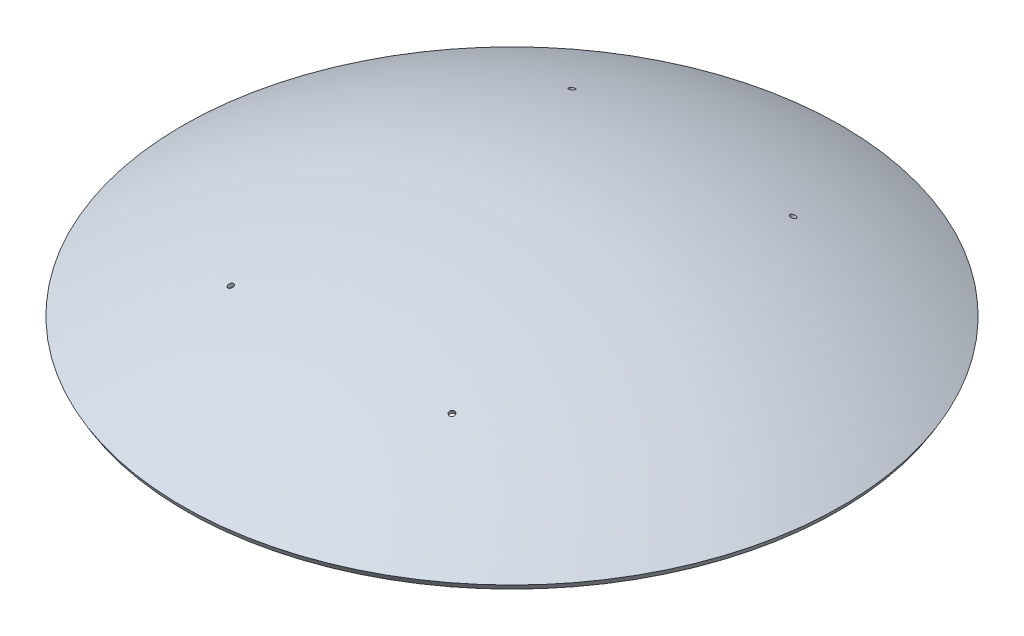
ISO-10303-21;
HEADER;
FILE_DESCRIPTION(('STEP AP214'),'2;1');
FILE_NAME('part.step','',(''),(''),'','','');
FILE_SCHEMA(('AUTOMOTIVE_DESIGN { 1 0 10303 214 1 1 1 1 }'));
ENDSEC;
DATA;
#1=APPLICATION_CONTEXT('core data for automotive mechanical design processes');
#2=APPLICATION_PROTOCOL_DEFINITION('international standard','automotive_design',2000,#1);
#3=PRODUCT_CONTEXT('',#1,'mechanical');
#4=PRODUCT('Part','Part','',(#3));
#5=PRODUCT_RELATED_PRODUCT_CATEGORY('part','',(#4));
#6=PRODUCT_DEFINITION_FORMATION('','',#4);
#7=PRODUCT_DEFINITION_CONTEXT('part definition',#1,'design');
#8=PRODUCT_DEFINITION('design','',#6,#7);
#9=PRODUCT_DEFINITION_SHAPE('','',#8);
#10=(LENGTH_UNIT() NAMED_UNIT(*) SI_UNIT(.MILLI.,.METRE.));
#11=(NAMED_UNIT(*) PLANE_ANGLE_UNIT() SI_UNIT($,.RADIAN.));
#12=(NAMED_UNIT(*) SI_UNIT($,.STERADIAN.) SOLID_ANGLE_UNIT());
#13=UNCERTAINTY_MEASURE_WITH_UNIT(LENGTH_MEASURE(1.E-05),#10,'distance_accuracy_value','');
#14=(GEOMETRIC_REPRESENTATION_CONTEXT(3) GLOBAL_UNCERTAINTY_ASSIGNED_CONTEXT((#13)) GLOBAL_UNIT_ASSIGNED_CONTEXT((#10,
#11,#12)) REPRESENTATION_CONTEXT('',''));
#15=CARTESIAN_POINT('',(0.,0.,0.));
#16=DIRECTION('',(0.,0.,1.));
#17=DIRECTION('',(1.,0.,0.));
#18=AXIS2_PLACEMENT_3D('',#15,#16,#17);
#19=CARTESIAN_POINT('',(0.,203515.969889343,0.));
#20=DIRECTION('',(0.,1.,0.));
#21=DIRECTION('',(0.,0.,1.));
#22=AXIS2_PLACEMENT_3D('',#19,#20,#21);
#23=CONICAL_SURFACE('',#22,117500.,0.523598775598306);
#24=CARTESIAN_POINT('',(0.,205681.033398804,0.));
#25=DIRECTION('',(0.,-1.,0.));
#26=DIRECTION('',(0.,0.,-1.));
#27=AXIS2_PLACEMENT_3D('',#24,#25,#26);
#28=CIRCLE('',#27,118750.);
#29=CARTESIAN_POINT('',(0.,205681.033398804,-118750.));
#30=VERTEX_POINT('',#29);
#31=EDGE_CURVE('E37',#30,#30,#28,.T.);
#32=ORIENTED_EDGE('',*,*,#31,.T.);
#33=EDGE_LOOP('',(#32));
#34=FACE_BOUND('',#33,.T.);
#35=CARTESIAN_POINT('',(0.,203515.969889343,0.));
#36=DIRECTION('',(0.,-1.,0.));
#37=DIRECTION('',(0.,0.,-1.));
#38=AXIS2_PLACEMENT_3D('',#35,#36,#37);
#39=CIRCLE('',#38,117500.);
#40=CARTESIAN_POINT('',(0.,203515.969889343,-117500.));
#41=VERTEX_POINT('',#40);
#42=EDGE_CURVE('E10',#41,#41,#39,.T.);
#43=ORIENTED_EDGE('',*,*,#42,.F.);
#44=EDGE_LOOP('',(#43));
#45=FACE_BOUND('',#44,.T.);
#46=ADVANCED_FACE('F31',(#34,#45),#23,.T.);
#47=CARTESIAN_POINT('',(0.,0.,0.));
#48=DIRECTION('',(0.,-1.,0.));
#49=DIRECTION('',(-1.,0.,0.));
#50=AXIS2_PLACEMENT_3D('',#47,#48,#49);
#51=SPHERICAL_SURFACE('',#50,235000.);
#52=CARTESIAN_POINT('',(-39413.6339756304,223525.825811059,-60817.519287778));
#53=DIRECTION('',(0.167731259496521,-0.951251242564198,0.258819045102522));
#54=DIRECTION('',(0.,0.262538491736643,0.964921520309631));
#55=AXIS2_PLACEMENT_3D('',#52,#53,#54);
#56=CIRCLE('',#55,3000.);
#57=CARTESIAN_POINT('',(-39413.6339756304,224313.441286269,-57922.7547268491));
#58=VERTEX_POINT('',#57);
#59=EDGE_CURVE('E89',#58,#58,#56,.T.);
#60=ORIENTED_EDGE('',*,*,#59,.F.);
#61=EDGE_LOOP('',(#60));
#62=FACE_BOUND('',#61,.T.);
#63=CARTESIAN_POINT('',(39413.6339756304,223525.825811059,-60817.519287778));
#64=DIRECTION('',(0.167731259496521,0.951251242564198,-0.258819045102522));
#65=DIRECTION('',(0.,0.262538491736643,0.964921520309631));
#66=AXIS2_PLACEMENT_3D('',#63,#64,#65);
#67=CIRCLE('',#66,3000.);
#68=CARTESIAN_POINT('',(39413.6339756304,224313.441286269,-57922.7547268491));
#69=VERTEX_POINT('',#68);
#70=EDGE_CURVE('E77',#69,#69,#67,.T.);
#71=ORIENTED_EDGE('',*,*,#70,.T.);
#72=EDGE_LOOP('',(#71));
#73=FACE_BOUND('',#72,.T.);
#74=CARTESIAN_POINT('',(-39413.6339756304,223525.825811059,60817.519287778));
#75=DIRECTION('',(-0.167731259496521,0.951251242564198,0.258819045102522));
#76=DIRECTION('',(0.,0.262538491736643,-0.964921520309631));
#77=AXIS2_PLACEMENT_3D('',#74,#75,#76);
#78=CIRCLE('',#77,3000.);
#79=CARTESIAN_POINT('',(-39413.6339756304,224313.441286269,57922.7547268491));
#80=VERTEX_POINT('',#79);
#81=EDGE_CURVE('E65',#80,#80,#78,.T.);
#82=ORIENTED_EDGE('',*,*,#81,.T.);
#83=EDGE_LOOP('',(#82));
#84=FACE_BOUND('',#83,.T.);
#85=CARTESIAN_POINT('',(39413.6339756304,223525.825811059,60817.519287778));
#86=DIRECTION('',(-0.167731259496521,-0.951251242564198,-0.258819045102522));
#87=DIRECTION('',(0.,0.262538491736643,-0.964921520309631));
#88=AXIS2_PLACEMENT_3D('',#85,#86,#87);
#89=CIRCLE('',#88,3000.);
#90=CARTESIAN_POINT('',(39413.6339756304,224313.441286269,57922.7547268491));
#91=VERTEX_POINT('',#90);
#92=EDGE_CURVE('E53',#91,#91,#89,.T.);
#93=ORIENTED_EDGE('',*,*,#92,.F.);
#94=EDGE_LOOP('',(#93));
#95=FACE_BOUND('',#94,.T.);
#96=ORIENTED_EDGE('',*,*,#42,.T.);
#97=EDGE_LOOP('',(#96));
#98=FACE_BOUND('',#97,.T.);
#99=ADVANCED_FACE('F95',(#62,#73,#84,#95,#98),#51,.F.);
#100=CARTESIAN_POINT('',(0.,0.,0.));
#101=DIRECTION('',(0.,-1.,0.));
#102=DIRECTION('',(-1.,0.,0.));
#103=AXIS2_PLACEMENT_3D('',#100,#101,#102);
#104=SPHERICAL_SURFACE('',#103,237500.);
#105=CARTESIAN_POINT('',(-39835.8210104176,225920.167465926,-61468.9783272337));
#106=DIRECTION('',(0.167731259496521,-0.951251242564198,0.258819045102522));
#107=DIRECTION('',(0.,0.262538491736643,0.964921520309631));
#108=AXIS2_PLACEMENT_3D('',#105,#106,#107);
#109=CIRCLE('',#108,1000.00000000001);
#110=CARTESIAN_POINT('',(-39835.8210104176,226182.705957663,-60504.056806924));
#111=VERTEX_POINT('',#110);
#112=EDGE_CURVE('E80',#111,#111,#109,.T.);
#113=ORIENTED_EDGE('',*,*,#112,.T.);
#114=EDGE_LOOP('',(#113));
#115=FACE_BOUND('',#114,.T.);
#116=CARTESIAN_POINT('',(39835.8210104176,225920.167465926,-61468.9783272337));
#117=DIRECTION('',(0.167731259496521,0.951251242564198,-0.258819045102522));
#118=DIRECTION('',(0.,0.262538491736643,0.964921520309631));
#119=AXIS2_PLACEMENT_3D('',#116,#117,#118);
#120=CIRCLE('',#119,1000.00000000001);
#121=CARTESIAN_POINT('',(39835.8210104176,226182.705957663,-60504.056806924));
#122=VERTEX_POINT('',#121);
#123=EDGE_CURVE('E68',#122,#122,#120,.T.);
#124=ORIENTED_EDGE('',*,*,#123,.F.);
#125=EDGE_LOOP('',(#124));
#126=FACE_BOUND('',#125,.T.);
#127=CARTESIAN_POINT('',(-39835.8210104176,225920.167465926,61468.9783272337));
#128=DIRECTION('',(-0.167731259496521,0.951251242564198,0.258819045102522));
#129=DIRECTION('',(0.,0.262538491736643,-0.964921520309631));
#130=AXIS2_PLACEMENT_3D('',#127,#128,#129);
#131=CIRCLE('',#130,1000.00000000001);
#132=CARTESIAN_POINT('',(-39835.8210104176,226182.705957663,60504.056806924));
#133=VERTEX_POINT('',#132);
#134=EDGE_CURVE('E56',#133,#133,#131,.T.);
#135=ORIENTED_EDGE('',*,*,#134,.F.);
#136=EDGE_LOOP('',(#135));
#137=FACE_BOUND('',#136,.T.);
#138=CARTESIAN_POINT('',(39835.8210104176,225920.167465926,61468.9783272337));
#139=DIRECTION('',(-0.167731259496521,-0.951251242564198,-0.258819045102522));
#140=DIRECTION('',(0.,0.262538491736643,-0.964921520309631));
#141=AXIS2_PLACEMENT_3D('',#138,#139,#140);
#142=CIRCLE('',#141,1000.00000000001);
#143=CARTESIAN_POINT('',(39835.8210104176,226182.705957663,60504.056806924));
#144=VERTEX_POINT('',#143);
#145=EDGE_CURVE('E41',#144,#144,#142,.T.);
#146=ORIENTED_EDGE('',*,*,#145,.T.);
#147=EDGE_LOOP('',(#146));
#148=FACE_BOUND('',#147,.T.);
#149=ORIENTED_EDGE('',*,*,#31,.F.);
#150=EDGE_LOOP('',(#149));
#151=FACE_BOUND('',#150,.T.);
#152=ADVANCED_FACE('F98',(#115,#126,#137,#148,#151),#104,.T.);
#153=CARTESIAN_POINT('',(35107.4661437942,199104.334474144,54172.8529946107));
#154=DIRECTION('',(-0.167731259496521,-0.951251242564198,-0.258819045102522));
#155=DIRECTION('',(0.,0.262538491736643,-0.964921520309631));
#156=AXIS2_PLACEMENT_3D('',#153,#154,#155);
#157=CYLINDRICAL_SURFACE('',#156,1000.00000000001);
#158=ORIENTED_EDGE('',*,*,#145,.F.);
#159=EDGE_LOOP('',(#158));
#160=FACE_BOUND('',#159,.T.);
#161=CARTESIAN_POINT('',(39626.1550676704,224731.092816631,61145.4516378424));
#162=DIRECTION('',(-0.167731259496521,-0.951251242564198,-0.258819045102522));
#163=DIRECTION('',(0.,0.262538491736643,-0.964921520309631));
#164=AXIS2_PLACEMENT_3D('',#161,#162,#163);
#165=CIRCLE('',#164,1000.00000000001);
#166=CARTESIAN_POINT('',(39671.0985231976,224985.979818873,60179.5258115615));
#167=VERTEX_POINT('',#166);
#168=EDGE_CURVE('E45',#167,#167,#165,.T.);
#169=ORIENTED_EDGE('',*,*,#168,.T.);
#170=EDGE_LOOP('',(#169));
#171=FACE_BOUND('',#170,.T.);
#172=ADVANCED_FACE('F118',(#160,#171),#157,.F.);
#173=CARTESIAN_POINT('',(0.,0.,0.));
#174=DIRECTION('',(-0.167731259496521,-0.951251242564198,-0.258819045102522));
#175=DIRECTION('',(0.044943455527548,0.25488700224418,-0.965925826289068));
#176=AXIS2_PLACEMENT_3D('',#173,#174,#175);
#177=SPHERICAL_SURFACE('',#176,236250.);
#178=CARTESIAN_POINT('',(39623.315046116,224714.986254022,61141.0693201457));
#179=DIRECTION('',(-0.167731259496521,-0.951251242564198,-0.258819045102522));
#180=DIRECTION('',(0.,0.262538491736643,-0.964921520309631));
#181=AXIS2_PLACEMENT_3D('',#178,#179,#180);
#182=CIRCLE('',#181,2999.99999999999);
#183=CARTESIAN_POINT('',(39758.1454126986,225479.647260754,58243.2918412807));
#184=VERTEX_POINT('',#183);
#185=EDGE_CURVE('E50',#184,#184,#182,.T.);
#186=CARTESIAN_POINT('',(39671.0985231976,224985.979818873,60179.5258115615));
#187=CARTESIAN_POINT('',(39672.0200814591,224991.206235487,60159.3789314537));
#188=CARTESIAN_POINT('',(39672.9411769422,224996.430027555,60139.2313493289));
#189=CARTESIAN_POINT('',(39674.782442287,225006.87236223,60098.9347824554));
#190=CARTESIAN_POINT('',(39675.7026121488,225012.090904838,60078.7857977068));
#191=CARTESIAN_POINT('',(39677.5420261867,225022.52274023,60038.4864269959));
#192=CARTESIAN_POINT('',(39678.4612703627,225027.736033013,60018.3360410337));
#193=CARTESIAN_POINT('',(39680.2988329648,225038.157368391,59978.0338693061));
#194=CARTESIAN_POINT('',(39681.2171513908,225043.365410985,59957.8820835407));
#195=CARTESIAN_POINT('',(39683.0528624284,225053.776245619,59917.5771136172));
#196=CARTESIAN_POINT('',(39683.9702550401,225058.979037659,59897.423929459));
#197=CARTESIAN_POINT('',(39685.8041143849,225069.379370821,59857.1161641606));
#198=CARTESIAN_POINT('',(39686.7205811181,225074.576911943,59836.9615830203));
#199=CARTESIAN_POINT('',(39688.5525886417,225084.966742904,59796.6510251683));
#200=CARTESIAN_POINT('',(39689.4681294321,225090.159032744,59776.4950484565));
#201=CARTESIAN_POINT('',(39691.2982850062,225100.538360779,59736.1817008722));
#202=CARTESIAN_POINT('',(39692.2128997899,225105.725398974,59716.0243299997));
#203=CARTESIAN_POINT('',(39694.0412032865,225116.094223355,59675.7081955047));
#204=CARTESIAN_POINT('',(39694.9548919994,225121.276009541,59655.5494318824));
#205=CARTESIAN_POINT('',(39696.7813432905,225131.634329542,59615.2305132987));
#206=CARTESIAN_POINT('',(39697.6941058686,225136.810863357,59595.0703583374));
#207=CARTESIAN_POINT('',(39699.5187048264,225147.158678254,59554.7486584869));
#208=CARTESIAN_POINT('',(39700.4305412059,225152.329959336,59534.5871135978));
#209=CARTESIAN_POINT('',(39702.2532877026,225162.667268405,59494.2626353028));
#210=CARTESIAN_POINT('',(39703.1641978197,225167.833296391,59474.0997018969));
#211=CARTESIAN_POINT('',(39704.9850917277,225178.160098907,59433.7724479797));
#212=CARTESIAN_POINT('',(39705.8950755186,225183.320873436,59413.6081274684));
#213=CARTESIAN_POINT('',(39707.7141167105,225193.637168677,59373.2781007517));
#214=CARTESIAN_POINT('',(39708.6231741115,225198.792689389,59353.1123945462));
#215=CARTESIAN_POINT('',(39710.44036246,225209.098476633,59312.7795978527));
#216=CARTESIAN_POINT('',(39711.3484934075,225214.248743165,59292.6125073646));
#217=CARTESIAN_POINT('',(39713.1638287855,225224.54402169,59252.2769435173));
#218=CARTESIAN_POINT('',(39714.0710332159,225229.689033683,59232.1084701581));
#219=CARTESIAN_POINT('',(39715.8845154962,225239.973802769,59191.7701419802));
#220=CARTESIAN_POINT('',(39716.790793346,225245.113559863,59171.6002871615));
#221=CARTESIAN_POINT('',(39718.6024224017,225255.38781879,59131.2591974763));
#222=CARTESIAN_POINT('',(39719.5077736075,225260.522320624,59111.0879626099));
#223=CARTESIAN_POINT('',(39721.3175493118,225270.786068674,59070.744114241));
#224=CARTESIAN_POINT('',(39722.2219738103,225275.915314889,59050.5715007386));
#225=CARTESIAN_POINT('',(39724.0298960365,225286.168551342,59010.2248965099));
#226=CARTESIAN_POINT('',(39724.9333937643,225291.29254158,58990.0509057835));
#227=CARTESIAN_POINT('',(39726.739462386,225301.535265718,58949.7015485188));
#228=CARTESIAN_POINT('',(39727.6420332798,225306.65399962,58929.5261819804));
#229=CARTESIAN_POINT('',(39729.4462481705,225316.886210728,58889.1740745039));
#230=CARTESIAN_POINT('',(39730.3478921672,225321.999687934,58868.9973335657));
#231=CARTESIAN_POINT('',(39732.1502532006,225332.221385295,58828.6424787016));
#232=CARTESIAN_POINT('',(39733.0509702372,225337.329605449,58808.4643647758));
#233=CARTESIAN_POINT('',(39734.8514772871,225347.540788348,58768.1067653488));
#234=CARTESIAN_POINT('',(39735.7512673004,225352.643751092,58747.9272798477));
#235=CARTESIAN_POINT('',(39737.5499202409,225362.844418813,58707.5669386824));
#236=CARTESIAN_POINT('',(39738.448783168,225367.94212379,58687.3860830183));
#237=CARTESIAN_POINT('',(39740.2455818731,225378.132275619,58647.0230029397));
#238=CARTESIAN_POINT('',(39741.1435176511,225383.224722472,58626.8407785252));
#239=CARTESIAN_POINT('',(39742.938461995,225393.404357697,58586.4749623585));
#240=CARTESIAN_POINT('',(39743.8354705611,225398.49154607,58566.2913706062));
#241=CARTESIAN_POINT('',(39745.6285604183,225408.660663978,58525.9228211764));
#242=CARTESIAN_POINT('',(39746.5246417095,225413.742593514,58505.737863499));
#243=CARTESIAN_POINT('',(39748.3158769545,225423.901193394,58465.3665836319));
#244=CARTESIAN_POINT('',(39749.2110309083,225428.977863737,58445.1802614421));
#245=CARTESIAN_POINT('',(39751.0004114156,225439.125944877,58404.8062539632));
#246=CARTESIAN_POINT('',(39751.8946379692,225444.197355673,58384.618568674));
#247=CARTESIAN_POINT('',(39753.6821636137,225454.334917363,58344.2418364092));
#248=CARTESIAN_POINT('',(39754.5754627046,225459.401068257,58324.0527894335));
#249=CARTESIAN_POINT('',(39756.3611333612,225469.528109787,58283.6733352089));
#250=CARTESIAN_POINT('',(39757.2535049268,225474.589000423,58263.4829279599));
#251=CARTESIAN_POINT('',(39758.1454126986,225479.647260754,58243.2918412807));
#252=B_SPLINE_CURVE_WITH_KNOTS('',3,(#186,#187,#188,#189,#190,#191,#192,#193,#194,#195,#196,
#197,#198,#199,#200,#201,#202,#203,#204,#205,#206,#207,#208,#209,#210,#211,#212,#213,#214,#215,
#216,#217,#218,#219,#220,#221,#222,#223,#224,#225,#226,#227,#228,#229,#230,#231,#232,#233,#234,
#235,#236,#237,#238,#239,#240,#241,#242,#243,#244,#245,#246,#247,#248,#249,#250,#251),
.UNSPECIFIED.,.F.,.F.,(4,2,2,2,2,2,2,2,2,2,2,2,2,2,2,2,2,2,2,2,2,2,2,2,2,2,2,2,2,2,2,2,4),(0.,
62.5024262105206,125.00485242106,187.507278631653,250.009704842173,312.512131052699,
375.014557263235,437.516983473755,500.019409684341,562.521835894869,625.024262105405,
687.526688315939,750.029114526474,812.531540736996,875.033966947585,937.536393158106,
1000.03881936865,1062.54124557917,1125.0436717897,1187.54609800029,1250.04852421082,
1312.55095042134,1375.05337663188,1437.5558028424,1500.05822905294,1562.56065526352,
1625.06308147405,1687.56550768458,1750.0679338951,1812.57036010563,1875.07278631621,
1937.57521252675,2000.07763873729),.UNSPECIFIED.);
#253=EDGE_CURVE('BSEAM108',#167,#184,#252,.T.);
#254=ORIENTED_EDGE('',*,*,#168,.F.);
#255=ORIENTED_EDGE('',*,*,#185,.T.);
#256=ORIENTED_EDGE('',*,*,#253,.T.);
#257=ORIENTED_EDGE('',*,*,#253,.F.);
#258=EDGE_LOOP('',(#254,#256,#255,#257));
#259=FACE_BOUND('',#258,.T.);
#260=ADVANCED_FACE('F108',(#259),#177,.F.);
#261=CARTESIAN_POINT('',(35107.4661437942,199104.334474144,54172.8529946107));
#262=DIRECTION('',(-0.167731259496521,-0.951251242564198,-0.258819045102522));
#263=DIRECTION('',(0.,0.262538491736643,-0.964921520309631));
#264=AXIS2_PLACEMENT_3D('',#261,#262,#263);
#265=CYLINDRICAL_SURFACE('',#264,2999.99999999999);
#266=ORIENTED_EDGE('',*,*,#185,.F.);
#267=EDGE_LOOP('',(#266));
#268=FACE_BOUND('',#267,.T.);
#269=ORIENTED_EDGE('',*,*,#92,.T.);
#270=EDGE_LOOP('',(#269));
#271=FACE_BOUND('',#270,.T.);
#272=ADVANCED_FACE('F105',(#268,#271),#265,.F.);
#273=CARTESIAN_POINT('',(-35107.4661437942,199104.334474144,54172.8529946107));
#274=DIRECTION('',(0.167731259496521,-0.951251242564198,-0.258819045102522));
#275=DIRECTION('',(0.,0.262538491736643,-0.964921520309631));
#276=AXIS2_PLACEMENT_3D('',#273,#274,#275);
#277=CYLINDRICAL_SURFACE('',#276,1000.00000000001);
#278=ORIENTED_EDGE('',*,*,#134,.T.);
#279=EDGE_LOOP('',(#278));
#280=FACE_BOUND('',#279,.T.);
#281=CARTESIAN_POINT('',(-39626.1550676704,224731.092816631,61145.4516378424));
#282=DIRECTION('',(-0.167731259496521,0.951251242564198,0.258819045102522));
#283=DIRECTION('',(0.,0.262538491736643,-0.964921520309631));
#284=AXIS2_PLACEMENT_3D('',#281,#282,#283);
#285=CIRCLE('',#284,1000.00000000001);
#286=CARTESIAN_POINT('',(-39671.0985231976,224985.979818873,60179.5258115615));
#287=VERTEX_POINT('',#286);
#288=EDGE_CURVE('E59',#287,#287,#285,.T.);
#289=ORIENTED_EDGE('',*,*,#288,.F.);
#290=EDGE_LOOP('',(#289));
#291=FACE_BOUND('',#290,.T.);
#292=ADVANCED_FACE('F107',(#280,#291),#277,.F.);
#293=CARTESIAN_POINT('',(0.,0.,0.));
#294=DIRECTION('',(0.167731259496521,-0.951251242564198,-0.258819045102522));
#295=DIRECTION('',(-0.044943455527548,0.25488700224418,-0.965925826289068));
#296=AXIS2_PLACEMENT_3D('',#293,#294,#295);
#297=SPHERICAL_SURFACE('',#296,236250.);
#298=CARTESIAN_POINT('',(-39623.315046116,224714.986254022,61141.0693201457));
#299=DIRECTION('',(-0.167731259496521,0.951251242564198,0.258819045102522));
#300=DIRECTION('',(0.,0.262538491736643,-0.964921520309631));
#301=AXIS2_PLACEMENT_3D('',#298,#299,#300);
#302=CIRCLE('',#301,2999.99999999999);
#303=CARTESIAN_POINT('',(-39758.1454126986,225479.647260754,58243.2918412807));
#304=VERTEX_POINT('',#303);
#305=EDGE_CURVE('E62',#304,#304,#302,.T.);
#306=CARTESIAN_POINT('',(-39671.0985231976,224985.979818873,60179.5258115615));
#307=CARTESIAN_POINT('',(-39672.0200814591,224991.206235487,60159.3789314537));
#308=CARTESIAN_POINT('',(-39672.9411769422,224996.430027555,60139.2313493289));
#309=CARTESIAN_POINT('',(-39674.782442287,225006.87236223,60098.9347824554));
#310=CARTESIAN_POINT('',(-39675.7026121488,225012.090904838,60078.7857977068));
#311=CARTESIAN_POINT('',(-39677.5420261867,225022.52274023,60038.4864269959));
#312=CARTESIAN_POINT('',(-39678.4612703627,225027.736033013,60018.3360410337));
#313=CARTESIAN_POINT('',(-39680.2988329648,225038.157368391,59978.0338693061));
#314=CARTESIAN_POINT('',(-39681.2171513908,225043.365410985,59957.8820835407));
#315=CARTESIAN_POINT('',(-39683.0528624284,225053.776245619,59917.5771136172));
#316=CARTESIAN_POINT('',(-39683.9702550401,225058.979037659,59897.423929459));
#317=CARTESIAN_POINT('',(-39685.8041143849,225069.379370821,59857.1161641606));
#318=CARTESIAN_POINT('',(-39686.7205811181,225074.576911943,59836.9615830203));
#319=CARTESIAN_POINT('',(-39688.5525886417,225084.966742904,59796.6510251683));
#320=CARTESIAN_POINT('',(-39689.4681294321,225090.159032744,59776.4950484565));
#321=CARTESIAN_POINT('',(-39691.2982850062,225100.538360779,59736.1817008722));
#322=CARTESIAN_POINT('',(-39692.2128997899,225105.725398974,59716.0243299997));
#323=CARTESIAN_POINT('',(-39694.0412032865,225116.094223355,59675.7081955047));
#324=CARTESIAN_POINT('',(-39694.9548919994,225121.276009541,59655.5494318824));
#325=CARTESIAN_POINT('',(-39696.7813432905,225131.634329542,59615.2305132987));
#326=CARTESIAN_POINT('',(-39697.6941058686,225136.810863357,59595.0703583374));
#327=CARTESIAN_POINT('',(-39699.5187048264,225147.158678254,59554.7486584869));
#328=CARTESIAN_POINT('',(-39700.4305412059,225152.329959336,59534.5871135978));
#329=CARTESIAN_POINT('',(-39702.2532877026,225162.667268405,59494.2626353028));
#330=CARTESIAN_POINT('',(-39703.1641978197,225167.833296391,59474.0997018969));
#331=CARTESIAN_POINT('',(-39704.9850917277,225178.160098907,59433.7724479797));
#332=CARTESIAN_POINT('',(-39705.8950755186,225183.320873436,59413.6081274684));
#333=CARTESIAN_POINT('',(-39707.7141167105,225193.637168677,59373.2781007517));
#334=CARTESIAN_POINT('',(-39708.6231741115,225198.792689389,59353.1123945462));
#335=CARTESIAN_POINT('',(-39710.44036246,225209.098476633,59312.7795978527));
#336=CARTESIAN_POINT('',(-39711.3484934075,225214.248743165,59292.6125073646));
#337=CARTESIAN_POINT('',(-39713.1638287855,225224.54402169,59252.2769435173));
#338=CARTESIAN_POINT('',(-39714.0710332159,225229.689033683,59232.1084701581));
#339=CARTESIAN_POINT('',(-39715.8845154962,225239.973802769,59191.7701419802));
#340=CARTESIAN_POINT('',(-39716.790793346,225245.113559863,59171.6002871615));
#341=CARTESIAN_POINT('',(-39718.6024224017,225255.38781879,59131.2591974763));
#342=CARTESIAN_POINT('',(-39719.5077736075,225260.522320624,59111.0879626099));
#343=CARTESIAN_POINT('',(-39721.3175493118,225270.786068674,59070.744114241));
#344=CARTESIAN_POINT('',(-39722.2219738103,225275.915314889,59050.5715007386));
#345=CARTESIAN_POINT('',(-39724.0298960365,225286.168551342,59010.2248965099));
#346=CARTESIAN_POINT('',(-39724.9333937643,225291.29254158,58990.0509057835));
#347=CARTESIAN_POINT('',(-39726.739462386,225301.535265718,58949.7015485188));
#348=CARTESIAN_POINT('',(-39727.6420332798,225306.65399962,58929.5261819804));
#349=CARTESIAN_POINT('',(-39729.4462481705,225316.886210728,58889.1740745039));
#350=CARTESIAN_POINT('',(-39730.3478921672,225321.999687934,58868.9973335657));
#351=CARTESIAN_POINT('',(-39732.1502532006,225332.221385295,58828.6424787016));
#352=CARTESIAN_POINT('',(-39733.0509702372,225337.329605449,58808.4643647758));
#353=CARTESIAN_POINT('',(-39734.8514772871,225347.540788348,58768.1067653488));
#354=CARTESIAN_POINT('',(-39735.7512673004,225352.643751092,58747.9272798477));
#355=CARTESIAN_POINT('',(-39737.5499202409,225362.844418813,58707.5669386824));
#356=CARTESIAN_POINT('',(-39738.448783168,225367.94212379,58687.3860830183));
#357=CARTESIAN_POINT('',(-39740.2455818731,225378.132275619,58647.0230029397));
#358=CARTESIAN_POINT('',(-39741.1435176511,225383.224722472,58626.8407785252));
#359=CARTESIAN_POINT('',(-39742.938461995,225393.404357697,58586.4749623585));
#360=CARTESIAN_POINT('',(-39743.8354705611,225398.49154607,58566.2913706062));
#361=CARTESIAN_POINT('',(-39745.6285604183,225408.660663978,58525.9228211764));
#362=CARTESIAN_POINT('',(-39746.5246417095,225413.742593514,58505.737863499));
#363=CARTESIAN_POINT('',(-39748.3158769545,225423.901193394,58465.3665836319));
#364=CARTESIAN_POINT('',(-39749.2110309083,225428.977863737,58445.1802614421));
#365=CARTESIAN_POINT('',(-39751.0004114156,225439.125944877,58404.8062539632));
#366=CARTESIAN_POINT('',(-39751.8946379692,225444.197355673,58384.618568674));
#367=CARTESIAN_POINT('',(-39753.6821636137,225454.334917363,58344.2418364092));
#368=CARTESIAN_POINT('',(-39754.5754627046,225459.401068257,58324.0527894335));
#369=CARTESIAN_POINT('',(-39756.3611333612,225469.528109787,58283.6733352089));
#370=CARTESIAN_POINT('',(-39757.2535049268,225474.589000423,58263.4829279599));
#371=CARTESIAN_POINT('',(-39758.1454126986,225479.647260754,58243.2918412807));
#372=B_SPLINE_CURVE_WITH_KNOTS('',3,(#306,#307,#308,#309,#310,#311,#312,#313,#314,#315,#316,
#317,#318,#319,#320,#321,#322,#323,#324,#325,#326,#327,#328,#329,#330,#331,#332,#333,#334,#335,
#336,#337,#338,#339,#340,#341,#342,#343,#344,#345,#346,#347,#348,#349,#350,#351,#352,#353,#354,
#355,#356,#357,#358,#359,#360,#361,#362,#363,#364,#365,#366,#367,#368,#369,#370,#371),
.UNSPECIFIED.,.F.,.F.,(4,2,2,2,2,2,2,2,2,2,2,2,2,2,2,2,2,2,2,2,2,2,2,2,2,2,2,2,2,2,2,2,4),(0.,
62.5024262105206,125.00485242106,187.507278631653,250.009704842173,312.512131052699,
375.014557263235,437.516983473755,500.019409684341,562.521835894869,625.024262105405,
687.526688315939,750.029114526474,812.531540736996,875.033966947585,937.536393158106,
1000.03881936865,1062.54124557917,1125.0436717897,1187.54609800029,1250.04852421082,
1312.55095042134,1375.05337663188,1437.5558028424,1500.05822905294,1562.56065526352,
1625.06308147405,1687.56550768458,1750.0679338951,1812.57036010563,1875.07278631621,
1937.57521252675,2000.07763873729),.UNSPECIFIED.);
#373=EDGE_CURVE('BSEAM115',#287,#304,#372,.T.);
#374=ORIENTED_EDGE('',*,*,#288,.T.);
#375=ORIENTED_EDGE('',*,*,#305,.F.);
#376=ORIENTED_EDGE('',*,*,#373,.T.);
#377=ORIENTED_EDGE('',*,*,#373,.F.);
#378=EDGE_LOOP('',(#374,#376,#375,#377));
#379=FACE_BOUND('',#378,.T.);
#380=ADVANCED_FACE('F115',(#379),#297,.F.);
#381=CARTESIAN_POINT('',(-35107.4661437942,199104.334474144,54172.8529946107));
#382=DIRECTION('',(0.167731259496521,-0.951251242564198,-0.258819045102522));
#383=DIRECTION('',(0.,0.262538491736643,-0.964921520309631));
#384=AXIS2_PLACEMENT_3D('',#381,#382,#383);
#385=CYLINDRICAL_SURFACE('',#384,2999.99999999999);
#386=ORIENTED_EDGE('',*,*,#305,.T.);
#387=EDGE_LOOP('',(#386));
#388=FACE_BOUND('',#387,.T.);
#389=ORIENTED_EDGE('',*,*,#81,.F.);
#390=EDGE_LOOP('',(#389));
#391=FACE_BOUND('',#390,.T.);
#392=ADVANCED_FACE('F168',(#388,#391),#385,.F.);
#393=CARTESIAN_POINT('',(35107.4661437942,199104.334474144,-54172.8529946107));
#394=DIRECTION('',(-0.167731259496521,-0.951251242564198,0.258819045102522));
#395=DIRECTION('',(0.,0.262538491736643,0.964921520309631));
#396=AXIS2_PLACEMENT_3D('',#393,#394,#395);
#397=CYLINDRICAL_SURFACE('',#396,1000.00000000001);
#398=ORIENTED_EDGE('',*,*,#123,.T.);
#399=EDGE_LOOP('',(#398));
#400=FACE_BOUND('',#399,.T.);
#401=CARTESIAN_POINT('',(39626.1550676704,224731.092816631,-61145.4516378424));
#402=DIRECTION('',(0.167731259496521,0.951251242564198,-0.258819045102522));
#403=DIRECTION('',(0.,0.262538491736643,0.964921520309631));
#404=AXIS2_PLACEMENT_3D('',#401,#402,#403);
#405=CIRCLE('',#404,1000.00000000001);
#406=CARTESIAN_POINT('',(39671.0985231976,224985.979818873,-60179.5258115615));
#407=VERTEX_POINT('',#406);
#408=EDGE_CURVE('E71',#407,#407,#405,.T.);
#409=ORIENTED_EDGE('',*,*,#408,.F.);
#410=EDGE_LOOP('',(#409));
#411=FACE_BOUND('',#410,.T.);
#412=ADVANCED_FACE('F177',(#400,#411),#397,.F.);
#413=CARTESIAN_POINT('',(0.,0.,0.));
#414=DIRECTION('',(-0.167731259496521,-0.951251242564198,0.258819045102522));
#415=DIRECTION('',(0.044943455527548,0.25488700224418,0.965925826289068));
#416=AXIS2_PLACEMENT_3D('',#413,#414,#415);
#417=SPHERICAL_SURFACE('',#416,236250.);
#418=CARTESIAN_POINT('',(39623.315046116,224714.986254022,-61141.0693201457));
#419=DIRECTION('',(0.167731259496521,0.951251242564198,-0.258819045102522));
#420=DIRECTION('',(0.,0.262538491736643,0.964921520309631));
#421=AXIS2_PLACEMENT_3D('',#418,#419,#420);
#422=CIRCLE('',#421,2999.99999999999);
#423=CARTESIAN_POINT('',(39758.1454126986,225479.647260754,-58243.2918412807));
#424=VERTEX_POINT('',#423);
#425=EDGE_CURVE('E74',#424,#424,#422,.T.);
#426=CARTESIAN_POINT('',(39671.0985231976,224985.979818873,-60179.5258115615));
#427=CARTESIAN_POINT('',(39672.0200814591,224991.206235487,-60159.3789314537));
#428=CARTESIAN_POINT('',(39672.9411769422,224996.430027555,-60139.2313493289));
#429=CARTESIAN_POINT('',(39674.782442287,225006.87236223,-60098.9347824554));
#430=CARTESIAN_POINT('',(39675.7026121488,225012.090904838,-60078.7857977068));
#431=CARTESIAN_POINT('',(39677.5420261867,225022.52274023,-60038.4864269959));
#432=CARTESIAN_POINT('',(39678.4612703627,225027.736033013,-60018.3360410337));
#433=CARTESIAN_POINT('',(39680.2988329648,225038.157368391,-59978.0338693061));
#434=CARTESIAN_POINT('',(39681.2171513908,225043.365410985,-59957.8820835407));
#435=CARTESIAN_POINT('',(39683.0528624284,225053.776245619,-59917.5771136172));
#436=CARTESIAN_POINT('',(39683.9702550401,225058.979037659,-59897.423929459));
#437=CARTESIAN_POINT('',(39685.8041143849,225069.379370821,-59857.1161641606));
#438=CARTESIAN_POINT('',(39686.7205811181,225074.576911943,-59836.9615830203));
#439=CARTESIAN_POINT('',(39688.5525886417,225084.966742904,-59796.6510251683));
#440=CARTESIAN_POINT('',(39689.4681294321,225090.159032744,-59776.4950484565));
#441=CARTESIAN_POINT('',(39691.2982850062,225100.538360779,-59736.1817008722));
#442=CARTESIAN_POINT('',(39692.2128997899,225105.725398974,-59716.0243299997));
#443=CARTESIAN_POINT('',(39694.0412032865,225116.094223355,-59675.7081955047));
#444=CARTESIAN_POINT('',(39694.9548919994,225121.276009541,-59655.5494318824));
#445=CARTESIAN_POINT('',(39696.7813432905,225131.634329542,-59615.2305132987));
#446=CARTESIAN_POINT('',(39697.6941058686,225136.810863357,-59595.0703583374));
#447=CARTESIAN_POINT('',(39699.5187048264,225147.158678254,-59554.7486584869));
#448=CARTESIAN_POINT('',(39700.4305412059,225152.329959336,-59534.5871135978));
#449=CARTESIAN_POINT('',(39702.2532877026,225162.667268405,-59494.2626353028));
#450=CARTESIAN_POINT('',(39703.1641978197,225167.833296391,-59474.0997018969));
#451=CARTESIAN_POINT('',(39704.9850917277,225178.160098907,-59433.7724479797));
#452=CARTESIAN_POINT('',(39705.8950755186,225183.320873436,-59413.6081274684));
#453=CARTESIAN_POINT('',(39707.7141167105,225193.637168677,-59373.2781007517));
#454=CARTESIAN_POINT('',(39708.6231741115,225198.792689389,-59353.1123945462));
#455=CARTESIAN_POINT('',(39710.44036246,225209.098476633,-59312.7795978527));
#456=CARTESIAN_POINT('',(39711.3484934075,225214.248743165,-59292.6125073646));
#457=CARTESIAN_POINT('',(39713.1638287855,225224.54402169,-59252.2769435173));
#458=CARTESIAN_POINT('',(39714.0710332159,225229.689033683,-59232.1084701581));
#459=CARTESIAN_POINT('',(39715.8845154962,225239.973802769,-59191.7701419802));
#460=CARTESIAN_POINT('',(39716.790793346,225245.113559863,-59171.6002871615));
#461=CARTESIAN_POINT('',(39718.6024224017,225255.38781879,-59131.2591974763));
#462=CARTESIAN_POINT('',(39719.5077736075,225260.522320624,-59111.0879626099));
#463=CARTESIAN_POINT('',(39721.3175493118,225270.786068674,-59070.744114241));
#464=CARTESIAN_POINT('',(39722.2219738103,225275.915314889,-59050.5715007386));
#465=CARTESIAN_POINT('',(39724.0298960365,225286.168551342,-59010.2248965099));
#466=CARTESIAN_POINT('',(39724.9333937643,225291.29254158,-58990.0509057835));
#467=CARTESIAN_POINT('',(39726.739462386,225301.535265718,-58949.7015485188));
#468=CARTESIAN_POINT('',(39727.6420332798,225306.65399962,-58929.5261819804));
#469=CARTESIAN_POINT('',(39729.4462481705,225316.886210728,-58889.1740745039));
#470=CARTESIAN_POINT('',(39730.3478921672,225321.999687934,-58868.9973335657));
#471=CARTESIAN_POINT('',(39732.1502532006,225332.221385295,-58828.6424787016));
#472=CARTESIAN_POINT('',(39733.0509702372,225337.329605449,-58808.4643647758));
#473=CARTESIAN_POINT('',(39734.8514772871,225347.540788348,-58768.1067653488));
#474=CARTESIAN_POINT('',(39735.7512673004,225352.643751092,-58747.9272798477));
#475=CARTESIAN_POINT('',(39737.5499202409,225362.844418813,-58707.5669386824));
#476=CARTESIAN_POINT('',(39738.448783168,225367.94212379,-58687.3860830183));
#477=CARTESIAN_POINT('',(39740.2455818731,225378.132275619,-58647.0230029397));
#478=CARTESIAN_POINT('',(39741.1435176511,225383.224722472,-58626.8407785252));
#479=CARTESIAN_POINT('',(39742.938461995,225393.404357697,-58586.4749623585));
#480=CARTESIAN_POINT('',(39743.8354705611,225398.49154607,-58566.2913706062));
#481=CARTESIAN_POINT('',(39745.6285604183,225408.660663978,-58525.9228211764));
#482=CARTESIAN_POINT('',(39746.5246417095,225413.742593514,-58505.737863499));
#483=CARTESIAN_POINT('',(39748.3158769545,225423.901193394,-58465.3665836319));
#484=CARTESIAN_POINT('',(39749.2110309083,225428.977863737,-58445.1802614421));
#485=CARTESIAN_POINT('',(39751.0004114156,225439.125944877,-58404.8062539632));
#486=CARTESIAN_POINT('',(39751.8946379692,225444.197355673,-58384.618568674));
#487=CARTESIAN_POINT('',(39753.6821636137,225454.334917363,-58344.2418364092));
#488=CARTESIAN_POINT('',(39754.5754627046,225459.401068257,-58324.0527894335));
#489=CARTESIAN_POINT('',(39756.3611333612,225469.528109787,-58283.6733352089));
#490=CARTESIAN_POINT('',(39757.2535049268,225474.589000423,-58263.4829279599));
#491=CARTESIAN_POINT('',(39758.1454126986,225479.647260754,-58243.2918412807));
#492=B_SPLINE_CURVE_WITH_KNOTS('',3,(#426,#427,#428,#429,#430,#431,#432,#433,#434,#435,#436,
#437,#438,#439,#440,#441,#442,#443,#444,#445,#446,#447,#448,#449,#450,#451,#452,#453,#454,#455,
#456,#457,#458,#459,#460,#461,#462,#463,#464,#465,#466,#467,#468,#469,#470,#471,#472,#473,#474,
#475,#476,#477,#478,#479,#480,#481,#482,#483,#484,#485,#486,#487,#488,#489,#490,#491),
.UNSPECIFIED.,.F.,.F.,(4,2,2,2,2,2,2,2,2,2,2,2,2,2,2,2,2,2,2,2,2,2,2,2,2,2,2,2,2,2,2,2,4),(0.,
62.5024262105206,125.00485242106,187.507278631653,250.009704842173,312.512131052699,
375.014557263235,437.516983473755,500.019409684341,562.521835894869,625.024262105405,
687.526688315939,750.029114526474,812.531540736996,875.033966947585,937.536393158106,
1000.03881936865,1062.54124557917,1125.0436717897,1187.54609800029,1250.04852421082,
1312.55095042134,1375.05337663188,1437.5558028424,1500.05822905294,1562.56065526352,
1625.06308147405,1687.56550768458,1750.0679338951,1812.57036010563,1875.07278631621,
1937.57521252675,2000.07763873729),.UNSPECIFIED.);
#493=EDGE_CURVE('BSEAM187',#407,#424,#492,.T.);
#494=ORIENTED_EDGE('',*,*,#408,.T.);
#495=ORIENTED_EDGE('',*,*,#425,.F.);
#496=ORIENTED_EDGE('',*,*,#493,.T.);
#497=ORIENTED_EDGE('',*,*,#493,.F.);
#498=EDGE_LOOP('',(#494,#496,#495,#497));
#499=FACE_BOUND('',#498,.T.);
#500=ADVANCED_FACE('F187',(#499),#417,.F.);
#501=CARTESIAN_POINT('',(35107.4661437942,199104.334474144,-54172.8529946107));
#502=DIRECTION('',(-0.167731259496521,-0.951251242564198,0.258819045102522));
#503=DIRECTION('',(0.,0.262538491736643,0.964921520309631));
#504=AXIS2_PLACEMENT_3D('',#501,#502,#503);
#505=CYLINDRICAL_SURFACE('',#504,2999.99999999999);
#506=ORIENTED_EDGE('',*,*,#425,.T.);
#507=EDGE_LOOP('',(#506));
#508=FACE_BOUND('',#507,.T.);
#509=ORIENTED_EDGE('',*,*,#70,.F.);
#510=EDGE_LOOP('',(#509));
#511=FACE_BOUND('',#510,.T.);
#512=ADVANCED_FACE('F194',(#508,#511),#505,.F.);
#513=CARTESIAN_POINT('',(-35107.4661437942,199104.334474144,-54172.8529946107));
#514=DIRECTION('',(0.167731259496521,-0.951251242564198,0.258819045102522));
#515=DIRECTION('',(0.,0.262538491736643,0.964921520309631));
#516=AXIS2_PLACEMENT_3D('',#513,#514,#515);
#517=CYLINDRICAL_SURFACE('',#516,1000.00000000001);
#518=ORIENTED_EDGE('',*,*,#112,.F.);
#519=EDGE_LOOP('',(#518));
#520=FACE_BOUND('',#519,.T.);
#521=CARTESIAN_POINT('',(-39626.1550676704,224731.092816631,-61145.4516378424));
#522=DIRECTION('',(0.167731259496521,-0.951251242564198,0.258819045102522));
#523=DIRECTION('',(0.,0.262538491736643,0.964921520309631));
#524=AXIS2_PLACEMENT_3D('',#521,#522,#523);
#525=CIRCLE('',#524,1000.00000000001);
#526=CARTESIAN_POINT('',(-39671.0985231976,224985.979818873,-60179.5258115615));
#527=VERTEX_POINT('',#526);
#528=EDGE_CURVE('E83',#527,#527,#525,.T.);
#529=ORIENTED_EDGE('',*,*,#528,.T.);
#530=EDGE_LOOP('',(#529));
#531=FACE_BOUND('',#530,.T.);
#532=ADVANCED_FACE('F202',(#520,#531),#517,.F.);
#533=CARTESIAN_POINT('',(0.,0.,0.));
#534=DIRECTION('',(0.167731259496521,-0.951251242564198,0.258819045102522));
#535=DIRECTION('',(-0.044943455527548,0.25488700224418,0.965925826289068));
#536=AXIS2_PLACEMENT_3D('',#533,#534,#535);
#537=SPHERICAL_SURFACE('',#536,236250.);
#538=CARTESIAN_POINT('',(-39623.315046116,224714.986254022,-61141.0693201457));
#539=DIRECTION('',(0.167731259496521,-0.951251242564198,0.258819045102522));
#540=DIRECTION('',(0.,0.262538491736643,0.964921520309631));
#541=AXIS2_PLACEMENT_3D('',#538,#539,#540);
#542=CIRCLE('',#541,2999.99999999999);
#543=CARTESIAN_POINT('',(-39758.1454126986,225479.647260754,-58243.2918412807));
#544=VERTEX_POINT('',#543);
#545=EDGE_CURVE('E86',#544,#544,#542,.T.);
#546=CARTESIAN_POINT('',(-39671.0985231976,224985.979818873,-60179.5258115615));
#547=CARTESIAN_POINT('',(-39672.0200814591,224991.206235487,-60159.3789314537));
#548=CARTESIAN_POINT('',(-39672.9411769422,224996.430027555,-60139.2313493289));
#549=CARTESIAN_POINT('',(-39674.782442287,225006.87236223,-60098.9347824554));
#550=CARTESIAN_POINT('',(-39675.7026121488,225012.090904838,-60078.7857977068));
#551=CARTESIAN_POINT('',(-39677.5420261867,225022.52274023,-60038.4864269959));
#552=CARTESIAN_POINT('',(-39678.4612703627,225027.736033013,-60018.3360410337));
#553=CARTESIAN_POINT('',(-39680.2988329648,225038.157368391,-59978.0338693061));
#554=CARTESIAN_POINT('',(-39681.2171513908,225043.365410985,-59957.8820835407));
#555=CARTESIAN_POINT('',(-39683.0528624284,225053.776245619,-59917.5771136172));
#556=CARTESIAN_POINT('',(-39683.9702550401,225058.979037659,-59897.423929459));
#557=CARTESIAN_POINT('',(-39685.8041143849,225069.379370821,-59857.1161641606));
#558=CARTESIAN_POINT('',(-39686.7205811181,225074.576911943,-59836.9615830203));
#559=CARTESIAN_POINT('',(-39688.5525886417,225084.966742904,-59796.6510251683));
#560=CARTESIAN_POINT('',(-39689.4681294321,225090.159032744,-59776.4950484565));
#561=CARTESIAN_POINT('',(-39691.2982850062,225100.538360779,-59736.1817008722));
#562=CARTESIAN_POINT('',(-39692.2128997899,225105.725398974,-59716.0243299997));
#563=CARTESIAN_POINT('',(-39694.0412032865,225116.094223355,-59675.7081955047));
#564=CARTESIAN_POINT('',(-39694.9548919994,225121.276009541,-59655.5494318824));
#565=CARTESIAN_POINT('',(-39696.7813432905,225131.634329542,-59615.2305132987));
#566=CARTESIAN_POINT('',(-39697.6941058686,225136.810863357,-59595.0703583374));
#567=CARTESIAN_POINT('',(-39699.5187048264,225147.158678254,-59554.7486584869));
#568=CARTESIAN_POINT('',(-39700.4305412059,225152.329959336,-59534.5871135978));
#569=CARTESIAN_POINT('',(-39702.2532877026,225162.667268405,-59494.2626353028));
#570=CARTESIAN_POINT('',(-39703.1641978197,225167.833296391,-59474.0997018969));
#571=CARTESIAN_POINT('',(-39704.9850917277,225178.160098907,-59433.7724479797));
#572=CARTESIAN_POINT('',(-39705.8950755186,225183.320873436,-59413.6081274684));
#573=CARTESIAN_POINT('',(-39707.7141167105,225193.637168677,-59373.2781007517));
#574=CARTESIAN_POINT('',(-39708.6231741115,225198.792689389,-59353.1123945462));
#575=CARTESIAN_POINT('',(-39710.44036246,225209.098476633,-59312.7795978527));
#576=CARTESIAN_POINT('',(-39711.3484934075,225214.248743165,-59292.6125073646));
#577=CARTESIAN_POINT('',(-39713.1638287855,225224.54402169,-59252.2769435173));
#578=CARTESIAN_POINT('',(-39714.0710332159,225229.689033683,-59232.1084701581));
#579=CARTESIAN_POINT('',(-39715.8845154962,225239.973802769,-59191.7701419802));
#580=CARTESIAN_POINT('',(-39716.790793346,225245.113559863,-59171.6002871615));
#581=CARTESIAN_POINT('',(-39718.6024224017,225255.38781879,-59131.2591974763));
#582=CARTESIAN_POINT('',(-39719.5077736075,225260.522320624,-59111.0879626099));
#583=CARTESIAN_POINT('',(-39721.3175493118,225270.786068674,-59070.744114241));
#584=CARTESIAN_POINT('',(-39722.2219738103,225275.915314889,-59050.5715007386));
#585=CARTESIAN_POINT('',(-39724.0298960365,225286.168551342,-59010.2248965099));
#586=CARTESIAN_POINT('',(-39724.9333937643,225291.29254158,-58990.0509057835));
#587=CARTESIAN_POINT('',(-39726.739462386,225301.535265718,-58949.7015485188));
#588=CARTESIAN_POINT('',(-39727.6420332798,225306.65399962,-58929.5261819804));
#589=CARTESIAN_POINT('',(-39729.4462481705,225316.886210728,-58889.1740745039));
#590=CARTESIAN_POINT('',(-39730.3478921672,225321.999687934,-58868.9973335657));
#591=CARTESIAN_POINT('',(-39732.1502532006,225332.221385295,-58828.6424787016));
#592=CARTESIAN_POINT('',(-39733.0509702372,225337.329605449,-58808.4643647758));
#593=CARTESIAN_POINT('',(-39734.8514772871,225347.540788348,-58768.1067653488));
#594=CARTESIAN_POINT('',(-39735.7512673004,225352.643751092,-58747.9272798477));
#595=CARTESIAN_POINT('',(-39737.5499202409,225362.844418813,-58707.5669386824));
#596=CARTESIAN_POINT('',(-39738.448783168,225367.94212379,-58687.3860830183));
#597=CARTESIAN_POINT('',(-39740.2455818731,225378.132275619,-58647.0230029397));
#598=CARTESIAN_POINT('',(-39741.1435176511,225383.224722472,-58626.8407785252));
#599=CARTESIAN_POINT('',(-39742.938461995,225393.404357697,-58586.4749623585));
#600=CARTESIAN_POINT('',(-39743.8354705611,225398.49154607,-58566.2913706062));
#601=CARTESIAN_POINT('',(-39745.6285604183,225408.660663978,-58525.9228211764));
#602=CARTESIAN_POINT('',(-39746.5246417095,225413.742593514,-58505.737863499));
#603=CARTESIAN_POINT('',(-39748.3158769545,225423.901193394,-58465.3665836319));
#604=CARTESIAN_POINT('',(-39749.2110309083,225428.977863737,-58445.1802614421));
#605=CARTESIAN_POINT('',(-39751.0004114156,225439.125944877,-58404.8062539632));
#606=CARTESIAN_POINT('',(-39751.8946379692,225444.197355673,-58384.618568674));
#607=CARTESIAN_POINT('',(-39753.6821636137,225454.334917363,-58344.2418364092));
#608=CARTESIAN_POINT('',(-39754.5754627046,225459.401068257,-58324.0527894335));
#609=CARTESIAN_POINT('',(-39756.3611333612,225469.528109787,-58283.6733352089));
#610=CARTESIAN_POINT('',(-39757.2535049268,225474.589000423,-58263.4829279599));
#611=CARTESIAN_POINT('',(-39758.1454126986,225479.647260754,-58243.2918412807));
#612=B_SPLINE_CURVE_WITH_KNOTS('',3,(#546,#547,#548,#549,#550,#551,#552,#553,#554,#555,#556,
#557,#558,#559,#560,#561,#562,#563,#564,#565,#566,#567,#568,#569,#570,#571,#572,#573,#574,#575,
#576,#577,#578,#579,#580,#581,#582,#583,#584,#585,#586,#587,#588,#589,#590,#591,#592,#593,#594,
#595,#596,#597,#598,#599,#600,#601,#602,#603,#604,#605,#606,#607,#608,#609,#610,#611),
.UNSPECIFIED.,.F.,.F.,(4,2,2,2,2,2,2,2,2,2,2,2,2,2,2,2,2,2,2,2,2,2,2,2,2,2,2,2,2,2,2,2,4),(0.,
62.5024262105206,125.00485242106,187.507278631653,250.009704842173,312.512131052699,
375.014557263235,437.516983473755,500.019409684341,562.521835894869,625.024262105405,
687.526688315939,750.029114526474,812.531540736996,875.033966947585,937.536393158106,
1000.03881936865,1062.54124557917,1125.0436717897,1187.54609800029,1250.04852421082,
1312.55095042134,1375.05337663188,1437.5558028424,1500.05822905294,1562.56065526352,
1625.06308147405,1687.56550768458,1750.0679338951,1812.57036010563,1875.07278631621,
1937.57521252675,2000.07763873729),.UNSPECIFIED.);
#613=EDGE_CURVE('BSEAM210',#527,#544,#612,.T.);
#614=ORIENTED_EDGE('',*,*,#528,.F.);
#615=ORIENTED_EDGE('',*,*,#545,.T.);
#616=ORIENTED_EDGE('',*,*,#613,.T.);
#617=ORIENTED_EDGE('',*,*,#613,.F.);
#618=EDGE_LOOP('',(#614,#616,#615,#617));
#619=FACE_BOUND('',#618,.T.);
#620=ADVANCED_FACE('F210',(#619),#537,.F.);
#621=CARTESIAN_POINT('',(-35107.4661437942,199104.334474144,-54172.8529946107));
#622=DIRECTION('',(0.167731259496521,-0.951251242564198,0.258819045102522));
#623=DIRECTION('',(0.,0.262538491736643,0.964921520309631));
#624=AXIS2_PLACEMENT_3D('',#621,#622,#623);
#625=CYLINDRICAL_SURFACE('',#624,2999.99999999999);
#626=ORIENTED_EDGE('',*,*,#545,.F.);
#627=EDGE_LOOP('',(#626));
#628=FACE_BOUND('',#627,.T.);
#629=ORIENTED_EDGE('',*,*,#59,.T.);
#630=EDGE_LOOP('',(#629));
#631=FACE_BOUND('',#630,.T.);
#632=ADVANCED_FACE('F93',(#628,#631),#625,.F.);
#633=CLOSED_SHELL('',(#46,#99,#152,#172,#260,#272,#292,#380,#392,#412,#500,#512,#532,#620,#632));
#634=MANIFOLD_SOLID_BREP('B2',#633);
#635=ADVANCED_BREP_SHAPE_REPRESENTATION('',(#18,#634),#14);
#636=SHAPE_DEFINITION_REPRESENTATION(#9,#635);
ENDSEC;
END-ISO-10303-21;
